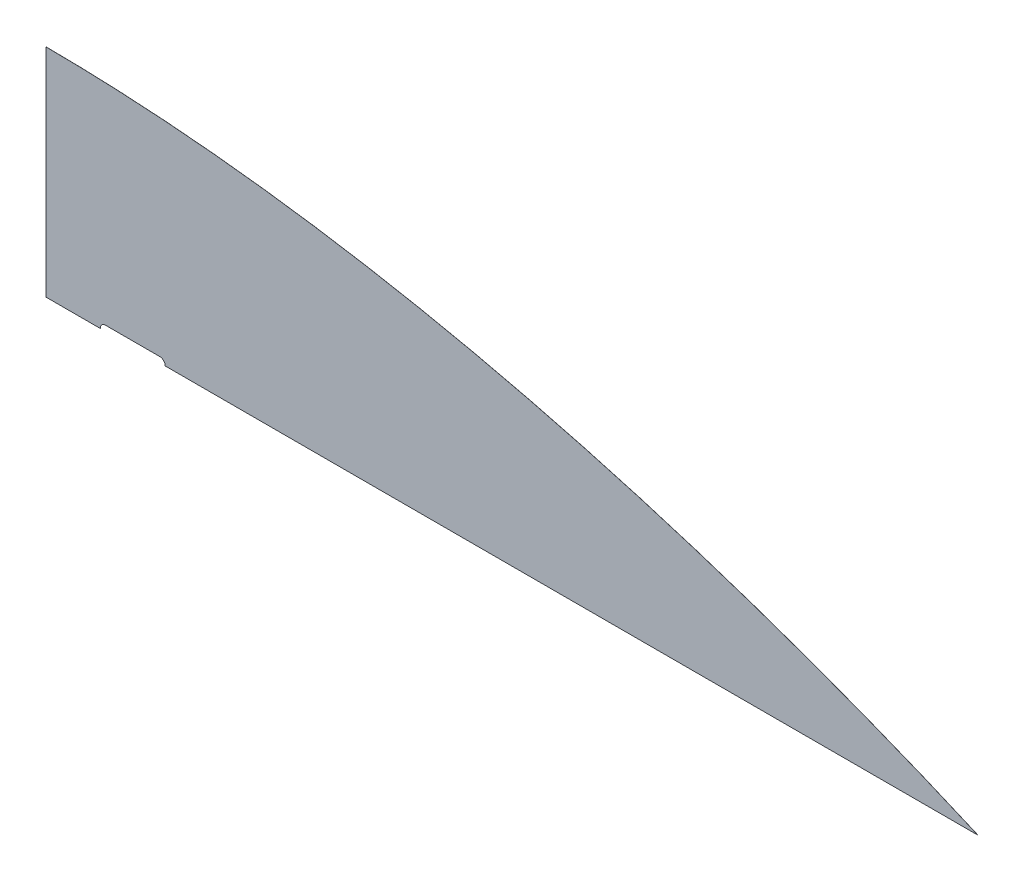
ISO-10303-21;
HEADER;
FILE_DESCRIPTION(('STEP AP214'),'2;1');
FILE_NAME('part.step','',(''),(''),'','','');
FILE_SCHEMA(('AUTOMOTIVE_DESIGN { 1 0 10303 214 1 1 1 1 }'));
ENDSEC;
DATA;
#1=APPLICATION_CONTEXT('core data for automotive mechanical design processes');
#2=APPLICATION_PROTOCOL_DEFINITION('international standard','automotive_design',2000,#1);
#3=PRODUCT_CONTEXT('',#1,'mechanical');
#4=PRODUCT('Part','Part','',(#3));
#5=PRODUCT_RELATED_PRODUCT_CATEGORY('part','',(#4));
#6=PRODUCT_DEFINITION_FORMATION('','',#4);
#7=PRODUCT_DEFINITION_CONTEXT('part definition',#1,'design');
#8=PRODUCT_DEFINITION('design','',#6,#7);
#9=PRODUCT_DEFINITION_SHAPE('','',#8);
#10=(LENGTH_UNIT() NAMED_UNIT(*) SI_UNIT(.MILLI.,.METRE.));
#11=(NAMED_UNIT(*) PLANE_ANGLE_UNIT() SI_UNIT($,.RADIAN.));
#12=(NAMED_UNIT(*) SI_UNIT($,.STERADIAN.) SOLID_ANGLE_UNIT());
#13=UNCERTAINTY_MEASURE_WITH_UNIT(LENGTH_MEASURE(1.E-05),#10,'distance_accuracy_value','');
#14=(GEOMETRIC_REPRESENTATION_CONTEXT(3) GLOBAL_UNCERTAINTY_ASSIGNED_CONTEXT((#13)) GLOBAL_UNIT_ASSIGNED_CONTEXT((#10,
#11,#12)) REPRESENTATION_CONTEXT('',''));
#15=CARTESIAN_POINT('',(0.,0.,0.));
#16=DIRECTION('',(0.,0.,1.));
#17=DIRECTION('',(1.,0.,0.));
#18=AXIS2_PLACEMENT_3D('',#15,#16,#17);
#19=CARTESIAN_POINT('',(0.,0.,0.127000000000002));
#20=DIRECTION('',(0.,1.,0.));
#21=DIRECTION('',(0.,0.,1.));
#22=AXIS2_PLACEMENT_3D('',#19,#20,#21);
#23=PLANE('',#22);
#24=DIRECTION('',(0.,0.,1.));
#25=VECTOR('',#24,1.);
#26=CARTESIAN_POINT('',(63.5,0.,0.));
#27=LINE('',#26,#25);
#28=CARTESIAN_POINT('',(63.4999999999999,0.,0.));
#29=VERTEX_POINT('',#28);
#30=CARTESIAN_POINT('',(63.4999999999999,0.,0.127000000000002));
#31=VERTEX_POINT('',#30);
#32=EDGE_CURVE('E126',#29,#31,#27,.T.);
#33=ORIENTED_EDGE('',*,*,#32,.T.);
#34=DIRECTION('',(1.,0.,0.));
#35=VECTOR('',#34,1.);
#36=CARTESIAN_POINT('',(0.,0.,0.127000000000002));
#37=LINE('',#36,#35);
#38=CARTESIAN_POINT('',(0.,0.,0.127000000000002));
#39=VERTEX_POINT('',#38);
#40=EDGE_CURVE('E144',#39,#31,#37,.T.);
#41=ORIENTED_EDGE('',*,*,#40,.F.);
#42=DIRECTION('',(0.,0.,-1.));
#43=VECTOR('',#42,1.);
#44=CARTESIAN_POINT('',(0.,0.,0.127000000000002));
#45=LINE('',#44,#43);
#46=CARTESIAN_POINT('',(0.,0.,0.));
#47=VERTEX_POINT('',#46);
#48=EDGE_CURVE('E43',#39,#47,#45,.T.);
#49=ORIENTED_EDGE('',*,*,#48,.T.);
#50=DIRECTION('',(1.,0.,0.));
#51=VECTOR('',#50,1.);
#52=CARTESIAN_POINT('',(0.,0.,0.));
#53=LINE('',#52,#51);
#54=EDGE_CURVE('E103',#47,#29,#53,.T.);
#55=ORIENTED_EDGE('',*,*,#54,.T.);
#56=EDGE_LOOP('',(#33,#41,#49,#55));
#57=FACE_BOUND('',#56,.T.);
#58=ADVANCED_FACE('F34',(#57),#23,.F.);
#59=DIRECTION('',(0.,0.,1.));
#60=VECTOR('',#59,1.);
#61=CARTESIAN_POINT('',(139.7,0.,0.));
#62=LINE('',#61,#60);
#63=CARTESIAN_POINT('',(139.7,0.,0.));
#64=VERTEX_POINT('',#63);
#65=CARTESIAN_POINT('',(139.7,0.,0.127000000000002));
#66=VERTEX_POINT('',#65);
#67=EDGE_CURVE('E108',#64,#66,#62,.T.);
#68=ORIENTED_EDGE('',*,*,#67,.F.);
#69=CARTESIAN_POINT('',(1092.2,0.,0.));
#70=VERTEX_POINT('',#69);
#71=EDGE_CURVE('E92',#64,#70,#53,.T.);
#72=ORIENTED_EDGE('',*,*,#71,.T.);
#73=DIRECTION('',(0.,0.,-1.));
#74=VECTOR('',#73,1.);
#75=CARTESIAN_POINT('',(1092.2,0.,0.127000000000002));
#76=LINE('',#75,#74);
#77=CARTESIAN_POINT('',(1092.2,0.,0.127000000000002));
#78=VERTEX_POINT('',#77);
#79=EDGE_CURVE('E146',#78,#70,#76,.T.);
#80=ORIENTED_EDGE('',*,*,#79,.F.);
#81=EDGE_CURVE('E110',#66,#78,#37,.T.);
#82=ORIENTED_EDGE('',*,*,#81,.F.);
#83=EDGE_LOOP('',(#68,#72,#80,#82));
#84=FACE_BOUND('',#83,.T.);
#85=ADVANCED_FACE('F109',(#84),#23,.F.);
#86=CARTESIAN_POINT('',(566.574596477157,179.041017308607,0.127000000000002));
#87=DIRECTION('',(0.,0.,1.));
#88=DIRECTION('',(1.,0.,0.));
#89=AXIS2_PLACEMENT_3D('',#86,#87,#88);
#90=PLANE('',#89);
#91=ORIENTED_EDGE('',*,*,#40,.T.);
#92=CARTESIAN_POINT('',(69.85,0.,0.127000000000002));
#93=DIRECTION('',(0.,0.,1.));
#94=DIRECTION('',(1.,0.,0.));
#95=AXIS2_PLACEMENT_3D('',#92,#93,#94);
#96=CIRCLE('',#95,6.35000000000008);
#97=CARTESIAN_POINT('',(69.85,6.35000000000016,0.127000000000002));
#98=VERTEX_POINT('',#97);
#99=EDGE_CURVE('E50',#31,#98,#96,.F.);
#100=ORIENTED_EDGE('',*,*,#99,.T.);
#101=DIRECTION('',(1.,0.,0.));
#102=VECTOR('',#101,1.);
#103=CARTESIAN_POINT('',(566.574596477157,6.35000000000027,0.127000000000002));
#104=LINE('',#103,#102);
#105=CARTESIAN_POINT('',(133.35,6.35000000000018,0.127000000000002));
#106=VERTEX_POINT('',#105);
#107=EDGE_CURVE('E54',#98,#106,#104,.T.);
#108=ORIENTED_EDGE('',*,*,#107,.T.);
#109=CARTESIAN_POINT('',(133.35,0.,0.127000000000002));
#110=DIRECTION('',(0.,0.,1.));
#111=DIRECTION('',(1.,0.,0.));
#112=AXIS2_PLACEMENT_3D('',#109,#110,#111);
#113=CIRCLE('',#112,6.35000000000017);
#114=EDGE_CURVE('E125',#106,#66,#113,.F.);
#115=ORIENTED_EDGE('',*,*,#114,.T.);
#116=ORIENTED_EDGE('',*,*,#81,.T.);
#117=CARTESIAN_POINT('',(1092.2,-3.05594159067454E-13,0.127000000000002));
#118=CARTESIAN_POINT('',(770.285770074945,140.499670678071,0.127000000000002));
#119=CARTESIAN_POINT('',(376.513153864139,252.276375478215,0.127000000000002));
#120=CARTESIAN_POINT('',(0.,254.,0.127000000000002));
#121=B_SPLINE_CURVE_WITH_KNOTS('',3,(#117,#118,#119,#120),.UNSPECIFIED.,.F.,.F.,(4,4),(0.,1.),.UNSPECIFIED.);
#122=CARTESIAN_POINT('',(0.,254.,0.127000000000002));
#123=VERTEX_POINT('',#122);
#124=EDGE_CURVE('E133',#78,#123,#121,.T.);
#125=ORIENTED_EDGE('',*,*,#124,.T.);
#126=DIRECTION('',(0.,-1.,0.));
#127=VECTOR('',#126,1.);
#128=CARTESIAN_POINT('',(0.,254.,0.127000000000002));
#129=LINE('',#128,#127);
#130=EDGE_CURVE('E139',#123,#39,#129,.T.);
#131=ORIENTED_EDGE('',*,*,#130,.T.);
#132=EDGE_LOOP('',(#91,#100,#108,#115,#116,#125,#131));
#133=FACE_BOUND('',#132,.T.);
#134=ADVANCED_FACE('F165',(#133),#90,.T.);
#135=CARTESIAN_POINT('',(566.574596477157,179.041017308607,0.));
#136=DIRECTION('',(0.,0.,1.));
#137=DIRECTION('',(1.,0.,0.));
#138=AXIS2_PLACEMENT_3D('',#135,#136,#137);
#139=PLANE('',#138);
#140=CARTESIAN_POINT('',(69.85,0.,0.));
#141=DIRECTION('',(0.,0.,-1.));
#142=DIRECTION('',(1.,0.,0.));
#143=AXIS2_PLACEMENT_3D('',#140,#141,#142);
#144=CIRCLE('',#143,6.35000000000008);
#145=CARTESIAN_POINT('',(69.85,6.35000000000016,0.));
#146=VERTEX_POINT('',#145);
#147=EDGE_CURVE('E123',#29,#146,#144,.T.);
#148=ORIENTED_EDGE('',*,*,#147,.F.);
#149=ORIENTED_EDGE('',*,*,#54,.F.);
#150=DIRECTION('',(0.,-1.,0.));
#151=VECTOR('',#150,1.);
#152=CARTESIAN_POINT('',(0.,254.,0.));
#153=LINE('',#152,#151);
#154=CARTESIAN_POINT('',(0.,254.,0.));
#155=VERTEX_POINT('',#154);
#156=EDGE_CURVE('E104',#155,#47,#153,.T.);
#157=ORIENTED_EDGE('',*,*,#156,.F.);
#158=CARTESIAN_POINT('',(1092.2,-3.05594159067454E-13,0.));
#159=CARTESIAN_POINT('',(770.285770074945,140.499670678071,0.));
#160=CARTESIAN_POINT('',(376.513153864139,252.276375478215,0.));
#161=CARTESIAN_POINT('',(0.,254.,0.));
#162=B_SPLINE_CURVE_WITH_KNOTS('',3,(#158,#159,#160,#161),.UNSPECIFIED.,.F.,.F.,(4,4),(0.,1.),.UNSPECIFIED.);
#163=EDGE_CURVE('E99',#70,#155,#162,.T.);
#164=ORIENTED_EDGE('',*,*,#163,.F.);
#165=ORIENTED_EDGE('',*,*,#71,.F.);
#166=CARTESIAN_POINT('',(133.35,0.,0.));
#167=DIRECTION('',(0.,0.,-1.));
#168=DIRECTION('',(-1.,0.,0.));
#169=AXIS2_PLACEMENT_3D('',#166,#167,#168);
#170=CIRCLE('',#169,6.35000000000017);
#171=CARTESIAN_POINT('',(133.35,6.35000000000018,0.));
#172=VERTEX_POINT('',#171);
#173=EDGE_CURVE('E96',#172,#64,#170,.T.);
#174=ORIENTED_EDGE('',*,*,#173,.F.);
#175=DIRECTION('',(1.,0.,0.));
#176=VECTOR('',#175,1.);
#177=CARTESIAN_POINT('',(69.85,6.35000000000017,0.));
#178=LINE('',#177,#176);
#179=EDGE_CURVE('E122',#146,#172,#178,.T.);
#180=ORIENTED_EDGE('',*,*,#179,.F.);
#181=EDGE_LOOP('',(#148,#149,#157,#164,#165,#174,#180));
#182=FACE_BOUND('',#181,.T.);
#183=ADVANCED_FACE('F94',(#182),#139,.F.);
#184=DIRECTION('',(0.,0.,-1.));
#185=VECTOR('',#184,1.);
#186=SURFACE_OF_LINEAR_EXTRUSION('',#121,#185);
#187=ORIENTED_EDGE('',*,*,#163,.T.);
#188=DIRECTION('',(0.,0.,-1.));
#189=VECTOR('',#188,1.);
#190=CARTESIAN_POINT('',(0.,254.,0.127000000000002));
#191=LINE('',#190,#189);
#192=EDGE_CURVE('E11',#123,#155,#191,.T.);
#193=ORIENTED_EDGE('',*,*,#192,.F.);
#194=ORIENTED_EDGE('',*,*,#124,.F.);
#195=ORIENTED_EDGE('',*,*,#79,.T.);
#196=EDGE_LOOP('',(#187,#193,#194,#195));
#197=FACE_BOUND('',#196,.T.);
#198=ADVANCED_FACE('F36',(#197),#186,.F.);
#199=CARTESIAN_POINT('',(0.,254.,0.127000000000002));
#200=DIRECTION('',(1.,0.,0.));
#201=DIRECTION('',(0.,1.,0.));
#202=AXIS2_PLACEMENT_3D('',#199,#200,#201);
#203=PLANE('',#202);
#204=ORIENTED_EDGE('',*,*,#156,.T.);
#205=ORIENTED_EDGE('',*,*,#48,.F.);
#206=ORIENTED_EDGE('',*,*,#130,.F.);
#207=ORIENTED_EDGE('',*,*,#192,.T.);
#208=EDGE_LOOP('',(#204,#205,#206,#207));
#209=FACE_BOUND('',#208,.T.);
#210=ADVANCED_FACE('F168',(#209),#203,.F.);
#211=CARTESIAN_POINT('',(69.85,0.,0.));
#212=DIRECTION('',(0.,0.,1.));
#213=DIRECTION('',(1.,0.,0.));
#214=AXIS2_PLACEMENT_3D('',#211,#212,#213);
#215=CYLINDRICAL_SURFACE('',#214,6.35000000000008);
#216=ORIENTED_EDGE('',*,*,#99,.F.);
#217=ORIENTED_EDGE('',*,*,#32,.F.);
#218=ORIENTED_EDGE('',*,*,#147,.T.);
#219=DIRECTION('',(0.,0.,1.));
#220=VECTOR('',#219,1.);
#221=CARTESIAN_POINT('',(69.85,6.35000000000008,0.));
#222=LINE('',#221,#220);
#223=EDGE_CURVE('E112',#146,#98,#222,.T.);
#224=ORIENTED_EDGE('',*,*,#223,.T.);
#225=EDGE_LOOP('',(#216,#217,#218,#224));
#226=FACE_BOUND('',#225,.T.);
#227=ADVANCED_FACE('F164',(#226),#215,.F.);
#228=CARTESIAN_POINT('',(69.85,6.35000000000017,0.));
#229=DIRECTION('',(0.,-1.,0.));
#230=DIRECTION('',(1.,0.,0.));
#231=AXIS2_PLACEMENT_3D('',#228,#229,#230);
#232=PLANE('',#231);
#233=ORIENTED_EDGE('',*,*,#107,.F.);
#234=ORIENTED_EDGE('',*,*,#223,.F.);
#235=ORIENTED_EDGE('',*,*,#179,.T.);
#236=DIRECTION('',(0.,0.,1.));
#237=VECTOR('',#236,1.);
#238=CARTESIAN_POINT('',(133.35,6.35000000000019,0.));
#239=LINE('',#238,#237);
#240=EDGE_CURVE('E116',#172,#106,#239,.T.);
#241=ORIENTED_EDGE('',*,*,#240,.T.);
#242=EDGE_LOOP('',(#233,#234,#235,#241));
#243=FACE_BOUND('',#242,.T.);
#244=ADVANCED_FACE('F186',(#243),#232,.T.);
#245=CARTESIAN_POINT('',(133.35,0.,0.));
#246=DIRECTION('',(0.,0.,1.));
#247=DIRECTION('',(1.,0.,0.));
#248=AXIS2_PLACEMENT_3D('',#245,#246,#247);
#249=CYLINDRICAL_SURFACE('',#248,6.35000000000017);
#250=ORIENTED_EDGE('',*,*,#114,.F.);
#251=ORIENTED_EDGE('',*,*,#240,.F.);
#252=ORIENTED_EDGE('',*,*,#173,.T.);
#253=ORIENTED_EDGE('',*,*,#67,.T.);
#254=EDGE_LOOP('',(#250,#251,#252,#253));
#255=FACE_BOUND('',#254,.T.);
#256=ADVANCED_FACE('F114',(#255),#249,.F.);
#257=CLOSED_SHELL('',(#58,#85,#134,#183,#198,#210,#227,#244,#256));
#258=MANIFOLD_SOLID_BREP('B2',#257);
#259=ADVANCED_BREP_SHAPE_REPRESENTATION('',(#18,#258),#14);
#260=SHAPE_DEFINITION_REPRESENTATION(#9,#259);
ENDSEC;
END-ISO-10303-21;
